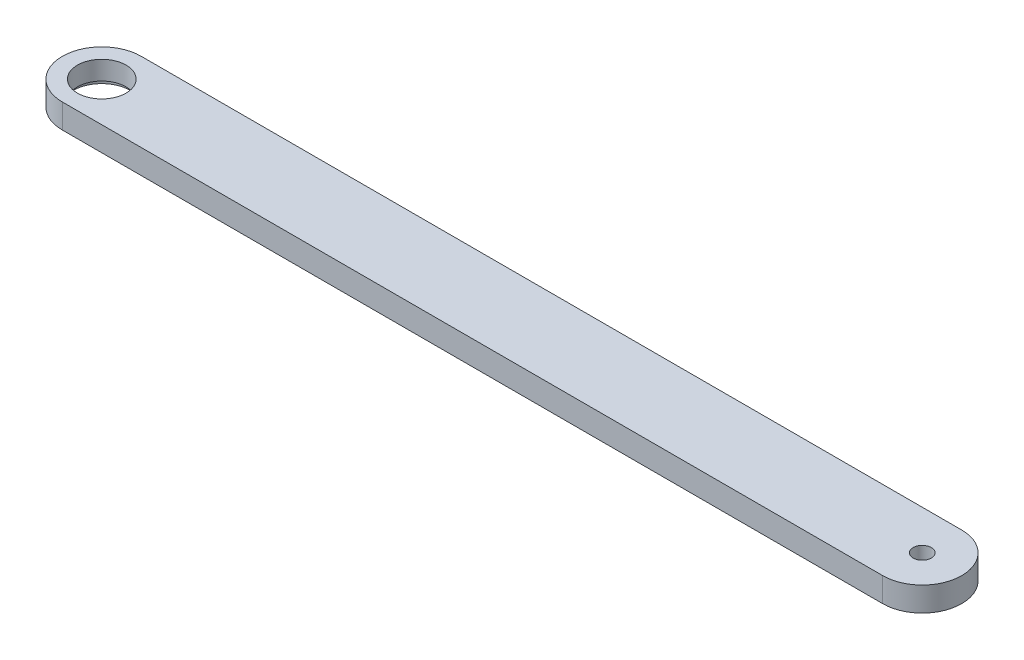
ISO-10303-21;
HEADER;
FILE_DESCRIPTION(('STEP AP214'),'2;1');
FILE_NAME('part.step','',(''),(''),'','','');
FILE_SCHEMA(('AUTOMOTIVE_DESIGN { 1 0 10303 214 1 1 1 1 }'));
ENDSEC;
DATA;
#1=APPLICATION_CONTEXT('core data for automotive mechanical design processes');
#2=APPLICATION_PROTOCOL_DEFINITION('international standard','automotive_design',2000,#1);
#3=PRODUCT_CONTEXT('',#1,'mechanical');
#4=PRODUCT('Part','Part','',(#3));
#5=PRODUCT_RELATED_PRODUCT_CATEGORY('part','',(#4));
#6=PRODUCT_DEFINITION_FORMATION('','',#4);
#7=PRODUCT_DEFINITION_CONTEXT('part definition',#1,'design');
#8=PRODUCT_DEFINITION('design','',#6,#7);
#9=PRODUCT_DEFINITION_SHAPE('','',#8);
#10=(LENGTH_UNIT() NAMED_UNIT(*) SI_UNIT(.MILLI.,.METRE.));
#11=(NAMED_UNIT(*) PLANE_ANGLE_UNIT() SI_UNIT($,.RADIAN.));
#12=(NAMED_UNIT(*) SI_UNIT($,.STERADIAN.) SOLID_ANGLE_UNIT());
#13=UNCERTAINTY_MEASURE_WITH_UNIT(LENGTH_MEASURE(1.E-05),#10,'distance_accuracy_value','');
#14=(GEOMETRIC_REPRESENTATION_CONTEXT(3) GLOBAL_UNCERTAINTY_ASSIGNED_CONTEXT((#13)) GLOBAL_UNIT_ASSIGNED_CONTEXT((#10,
#11,#12)) REPRESENTATION_CONTEXT('',''));
#15=CARTESIAN_POINT('',(0.,0.,0.));
#16=DIRECTION('',(0.,0.,1.));
#17=DIRECTION('',(1.,0.,0.));
#18=AXIS2_PLACEMENT_3D('',#15,#16,#17);
#19=CARTESIAN_POINT('',(-67.5,4.,0.));
#20=DIRECTION('',(0.,-1.,0.));
#21=DIRECTION('',(0.,0.,-1.));
#22=AXIS2_PLACEMENT_3D('',#19,#20,#21);
#23=CYLINDRICAL_SURFACE('',#22,6.50000000000002);
#24=CARTESIAN_POINT('',(-67.5,0.,0.));
#25=DIRECTION('',(0.,1.,0.));
#26=DIRECTION('',(0.,0.,1.));
#27=AXIS2_PLACEMENT_3D('',#24,#25,#26);
#28=CIRCLE('',#27,6.50000000000002);
#29=CARTESIAN_POINT('',(-67.5,0.,-6.50000000000002));
#30=VERTEX_POINT('',#29);
#31=CARTESIAN_POINT('',(-67.5,0.,6.50000000000002));
#32=VERTEX_POINT('',#31);
#33=EDGE_CURVE('E106',#30,#32,#28,.T.);
#34=ORIENTED_EDGE('',*,*,#33,.T.);
#35=DIRECTION('',(0.,-1.,0.));
#36=VECTOR('',#35,1.);
#37=CARTESIAN_POINT('',(-67.5,4.,6.50000000000002));
#38=LINE('',#37,#36);
#39=CARTESIAN_POINT('',(-67.5,4.,6.50000000000002));
#40=VERTEX_POINT('',#39);
#41=EDGE_CURVE('E11',#40,#32,#38,.T.);
#42=ORIENTED_EDGE('',*,*,#41,.F.);
#43=CARTESIAN_POINT('',(-67.5,4.,0.));
#44=DIRECTION('',(0.,1.,0.));
#45=DIRECTION('',(0.,0.,1.));
#46=AXIS2_PLACEMENT_3D('',#43,#44,#45);
#47=CIRCLE('',#46,6.50000000000002);
#48=CARTESIAN_POINT('',(-67.5,4.,-6.50000000000002));
#49=VERTEX_POINT('',#48);
#50=EDGE_CURVE('E93',#49,#40,#47,.T.);
#51=ORIENTED_EDGE('',*,*,#50,.F.);
#52=DIRECTION('',(0.,-1.,0.));
#53=VECTOR('',#52,1.);
#54=CARTESIAN_POINT('',(-67.5,4.,-6.50000000000002));
#55=LINE('',#54,#53);
#56=EDGE_CURVE('E102',#49,#30,#55,.T.);
#57=ORIENTED_EDGE('',*,*,#56,.T.);
#58=EDGE_LOOP('',(#34,#42,#51,#57));
#59=FACE_BOUND('',#58,.T.);
#60=ADVANCED_FACE('F41',(#59),#23,.T.);
#61=CARTESIAN_POINT('',(-67.5,4.,6.50000000000002));
#62=DIRECTION('',(0.,0.,-1.));
#63=DIRECTION('',(-1.,0.,0.));
#64=AXIS2_PLACEMENT_3D('',#61,#62,#63);
#65=PLANE('',#64);
#66=DIRECTION('',(1.,0.,0.));
#67=VECTOR('',#66,1.);
#68=CARTESIAN_POINT('',(-67.5,0.,6.50000000000002));
#69=LINE('',#68,#67);
#70=CARTESIAN_POINT('',(67.5,0.,6.5));
#71=VERTEX_POINT('',#70);
#72=EDGE_CURVE('E97',#32,#71,#69,.T.);
#73=ORIENTED_EDGE('',*,*,#72,.T.);
#74=DIRECTION('',(0.,-1.,0.));
#75=VECTOR('',#74,1.);
#76=CARTESIAN_POINT('',(67.5,4.,6.5));
#77=LINE('',#76,#75);
#78=CARTESIAN_POINT('',(67.5,4.,6.5));
#79=VERTEX_POINT('',#78);
#80=EDGE_CURVE('E50',#79,#71,#77,.T.);
#81=ORIENTED_EDGE('',*,*,#80,.F.);
#82=DIRECTION('',(1.,0.,0.));
#83=VECTOR('',#82,1.);
#84=CARTESIAN_POINT('',(-67.5,4.,6.50000000000002));
#85=LINE('',#84,#83);
#86=EDGE_CURVE('E88',#40,#79,#85,.T.);
#87=ORIENTED_EDGE('',*,*,#86,.F.);
#88=ORIENTED_EDGE('',*,*,#41,.T.);
#89=EDGE_LOOP('',(#73,#81,#87,#88));
#90=FACE_BOUND('',#89,.T.);
#91=ADVANCED_FACE('F96',(#90),#65,.F.);
#92=CARTESIAN_POINT('',(67.5,4.,0.));
#93=DIRECTION('',(0.,-1.,0.));
#94=DIRECTION('',(0.,0.,-1.));
#95=AXIS2_PLACEMENT_3D('',#92,#93,#94);
#96=CYLINDRICAL_SURFACE('',#95,6.50000000000002);
#97=CARTESIAN_POINT('',(67.5,0.,0.));
#98=DIRECTION('',(0.,1.,0.));
#99=DIRECTION('',(0.,0.,1.));
#100=AXIS2_PLACEMENT_3D('',#97,#98,#99);
#101=CIRCLE('',#100,6.50000000000002);
#102=CARTESIAN_POINT('',(67.5,0.,-6.50000000000005));
#103=VERTEX_POINT('',#102);
#104=EDGE_CURVE('E75',#71,#103,#101,.T.);
#105=ORIENTED_EDGE('',*,*,#104,.T.);
#106=DIRECTION('',(0.,-1.,0.));
#107=VECTOR('',#106,1.);
#108=CARTESIAN_POINT('',(67.5,4.,-6.50000000000005));
#109=LINE('',#108,#107);
#110=CARTESIAN_POINT('',(67.5,4.,-6.50000000000005));
#111=VERTEX_POINT('',#110);
#112=EDGE_CURVE('E98',#111,#103,#109,.T.);
#113=ORIENTED_EDGE('',*,*,#112,.F.);
#114=CARTESIAN_POINT('',(67.5,4.,0.));
#115=DIRECTION('',(0.,1.,0.));
#116=DIRECTION('',(0.,0.,1.));
#117=AXIS2_PLACEMENT_3D('',#114,#115,#116);
#118=CIRCLE('',#117,6.50000000000002);
#119=EDGE_CURVE('E91',#79,#111,#118,.T.);
#120=ORIENTED_EDGE('',*,*,#119,.F.);
#121=ORIENTED_EDGE('',*,*,#80,.T.);
#122=EDGE_LOOP('',(#105,#113,#120,#121));
#123=FACE_BOUND('',#122,.T.);
#124=ADVANCED_FACE('F100',(#123),#96,.T.);
#125=CARTESIAN_POINT('',(-67.5,4.,-6.50000000000002));
#126=DIRECTION('',(0.,0.,1.));
#127=DIRECTION('',(1.,0.,0.));
#128=AXIS2_PLACEMENT_3D('',#125,#126,#127);
#129=PLANE('',#128);
#130=DIRECTION('',(-1.,0.,0.));
#131=VECTOR('',#130,1.);
#132=CARTESIAN_POINT('',(-67.5,0.,-6.50000000000002));
#133=LINE('',#132,#131);
#134=EDGE_CURVE('E81',#103,#30,#133,.T.);
#135=ORIENTED_EDGE('',*,*,#134,.T.);
#136=ORIENTED_EDGE('',*,*,#56,.F.);
#137=DIRECTION('',(-1.,0.,0.));
#138=VECTOR('',#137,1.);
#139=CARTESIAN_POINT('',(-67.5,4.,-6.50000000000002));
#140=LINE('',#139,#138);
#141=EDGE_CURVE('E58',#111,#49,#140,.T.);
#142=ORIENTED_EDGE('',*,*,#141,.F.);
#143=ORIENTED_EDGE('',*,*,#112,.T.);
#144=EDGE_LOOP('',(#135,#136,#142,#143));
#145=FACE_BOUND('',#144,.T.);
#146=ADVANCED_FACE('F113',(#145),#129,.F.);
#147=CARTESIAN_POINT('',(-67.5,4.,0.));
#148=DIRECTION('',(0.,1.,0.));
#149=DIRECTION('',(0.,0.,1.));
#150=AXIS2_PLACEMENT_3D('',#147,#148,#149);
#151=PLANE('',#150);
#152=CARTESIAN_POINT('',(67.5,4.,0.));
#153=DIRECTION('',(0.,1.,0.));
#154=DIRECTION('',(0.,0.,1.));
#155=AXIS2_PLACEMENT_3D('',#152,#153,#154);
#156=CIRCLE('',#155,1.5);
#157=CARTESIAN_POINT('',(67.5,4.,1.49999999999998));
#158=VERTEX_POINT('',#157);
#159=EDGE_CURVE('E131',#158,#158,#156,.T.);
#160=ORIENTED_EDGE('',*,*,#159,.F.);
#161=EDGE_LOOP('',(#160));
#162=FACE_BOUND('',#161,.T.);
#163=CARTESIAN_POINT('',(-67.5,4.,0.));
#164=DIRECTION('',(0.,1.,0.));
#165=DIRECTION('',(0.,0.,1.));
#166=AXIS2_PLACEMENT_3D('',#163,#164,#165);
#167=CIRCLE('',#166,4.);
#168=CARTESIAN_POINT('',(-67.5,4.,4.));
#169=VERTEX_POINT('',#168);
#170=EDGE_CURVE('E44',#169,#169,#167,.T.);
#171=ORIENTED_EDGE('',*,*,#170,.F.);
#172=EDGE_LOOP('',(#171));
#173=FACE_BOUND('',#172,.T.);
#174=ORIENTED_EDGE('',*,*,#50,.T.);
#175=ORIENTED_EDGE('',*,*,#86,.T.);
#176=ORIENTED_EDGE('',*,*,#119,.T.);
#177=ORIENTED_EDGE('',*,*,#141,.T.);
#178=EDGE_LOOP('',(#174,#175,#176,#177));
#179=FACE_BOUND('',#178,.T.);
#180=ADVANCED_FACE('F89',(#162,#173,#179),#151,.T.);
#181=CARTESIAN_POINT('',(-67.5,0.,0.));
#182=DIRECTION('',(0.,1.,0.));
#183=DIRECTION('',(0.,0.,1.));
#184=AXIS2_PLACEMENT_3D('',#181,#182,#183);
#185=PLANE('',#184);
#186=CARTESIAN_POINT('',(67.5,0.,0.));
#187=DIRECTION('',(0.,1.,0.));
#188=DIRECTION('',(0.,0.,1.));
#189=AXIS2_PLACEMENT_3D('',#186,#187,#188);
#190=CIRCLE('',#189,1.5);
#191=CARTESIAN_POINT('',(67.5,0.,1.49999999999998));
#192=VERTEX_POINT('',#191);
#193=EDGE_CURVE('E128',#192,#192,#190,.T.);
#194=ORIENTED_EDGE('',*,*,#193,.T.);
#195=EDGE_LOOP('',(#194));
#196=FACE_BOUND('',#195,.T.);
#197=CARTESIAN_POINT('',(-67.5,0.,0.));
#198=DIRECTION('',(0.,-1.,0.));
#199=DIRECTION('',(0.,0.,-1.));
#200=AXIS2_PLACEMENT_3D('',#197,#198,#199);
#201=CIRCLE('',#200,4.74999999999999);
#202=CARTESIAN_POINT('',(-67.5,0.,-4.74999999999999));
#203=VERTEX_POINT('',#202);
#204=EDGE_CURVE('E125',#203,#203,#201,.T.);
#205=ORIENTED_EDGE('',*,*,#204,.F.);
#206=EDGE_LOOP('',(#205));
#207=FACE_BOUND('',#206,.T.);
#208=ORIENTED_EDGE('',*,*,#33,.F.);
#209=ORIENTED_EDGE('',*,*,#134,.F.);
#210=ORIENTED_EDGE('',*,*,#104,.F.);
#211=ORIENTED_EDGE('',*,*,#72,.F.);
#212=EDGE_LOOP('',(#208,#209,#210,#211));
#213=FACE_BOUND('',#212,.T.);
#214=ADVANCED_FACE('F116',(#196,#207,#213),#185,.F.);
#215=CARTESIAN_POINT('',(-67.5,0.,0.));
#216=DIRECTION('',(0.,-1.,0.));
#217=DIRECTION('',(0.,0.,-1.));
#218=AXIS2_PLACEMENT_3D('',#215,#216,#217);
#219=CYLINDRICAL_SURFACE('',#218,4.);
#220=ORIENTED_EDGE('',*,*,#170,.T.);
#221=EDGE_LOOP('',(#220));
#222=FACE_BOUND('',#221,.T.);
#223=CARTESIAN_POINT('',(-67.5,0.899999999999998,0.));
#224=DIRECTION('',(0.,-1.,0.));
#225=DIRECTION('',(0.,0.,-1.));
#226=AXIS2_PLACEMENT_3D('',#223,#224,#225);
#227=CIRCLE('',#226,4.);
#228=CARTESIAN_POINT('',(-67.5,0.899999999999998,-4.));
#229=VERTEX_POINT('',#228);
#230=EDGE_CURVE('E119',#229,#229,#227,.T.);
#231=ORIENTED_EDGE('',*,*,#230,.T.);
#232=EDGE_LOOP('',(#231));
#233=FACE_BOUND('',#232,.T.);
#234=ADVANCED_FACE('F144',(#222,#233),#219,.F.);
#235=CARTESIAN_POINT('',(-63.5,0.9,0.));
#236=DIRECTION('',(0.,1.,0.));
#237=DIRECTION('',(0.,0.,1.));
#238=AXIS2_PLACEMENT_3D('',#235,#236,#237);
#239=PLANE('',#238);
#240=ORIENTED_EDGE('',*,*,#230,.F.);
#241=EDGE_LOOP('',(#240));
#242=FACE_BOUND('',#241,.T.);
#243=CARTESIAN_POINT('',(-67.5,0.900000000000001,0.));
#244=DIRECTION('',(0.,-1.,0.));
#245=DIRECTION('',(0.,0.,-1.));
#246=AXIS2_PLACEMENT_3D('',#243,#244,#245);
#247=CIRCLE('',#246,4.74999999999999);
#248=CARTESIAN_POINT('',(-67.5,0.900000000000001,-4.74999999999999));
#249=VERTEX_POINT('',#248);
#250=EDGE_CURVE('E122',#249,#249,#247,.T.);
#251=ORIENTED_EDGE('',*,*,#250,.T.);
#252=EDGE_LOOP('',(#251));
#253=FACE_BOUND('',#252,.T.);
#254=ADVANCED_FACE('F147',(#242,#253),#239,.F.);
#255=CARTESIAN_POINT('',(-67.5,0.,0.));
#256=DIRECTION('',(0.,-1.,0.));
#257=DIRECTION('',(0.,0.,-1.));
#258=AXIS2_PLACEMENT_3D('',#255,#256,#257);
#259=CYLINDRICAL_SURFACE('',#258,4.74999999999999);
#260=ORIENTED_EDGE('',*,*,#250,.F.);
#261=EDGE_LOOP('',(#260));
#262=FACE_BOUND('',#261,.T.);
#263=ORIENTED_EDGE('',*,*,#204,.T.);
#264=EDGE_LOOP('',(#263));
#265=FACE_BOUND('',#264,.T.);
#266=ADVANCED_FACE('F153',(#262,#265),#259,.F.);
#267=CARTESIAN_POINT('',(67.5,4.,0.));
#268=DIRECTION('',(0.,1.,0.));
#269=DIRECTION('',(0.,0.,1.));
#270=AXIS2_PLACEMENT_3D('',#267,#268,#269);
#271=CYLINDRICAL_SURFACE('',#270,1.5);
#272=ORIENTED_EDGE('',*,*,#159,.T.);
#273=EDGE_LOOP('',(#272));
#274=FACE_BOUND('',#273,.T.);
#275=ORIENTED_EDGE('',*,*,#193,.F.);
#276=EDGE_LOOP('',(#275));
#277=FACE_BOUND('',#276,.T.);
#278=ADVANCED_FACE('F135',(#274,#277),#271,.F.);
#279=CLOSED_SHELL('',(#60,#91,#124,#146,#180,#214,#234,#254,#266,#278));
#280=MANIFOLD_SOLID_BREP('B2',#279);
#281=ADVANCED_BREP_SHAPE_REPRESENTATION('',(#18,#280),#14);
#282=SHAPE_DEFINITION_REPRESENTATION(#9,#281);
ENDSEC;
END-ISO-10303-21;
